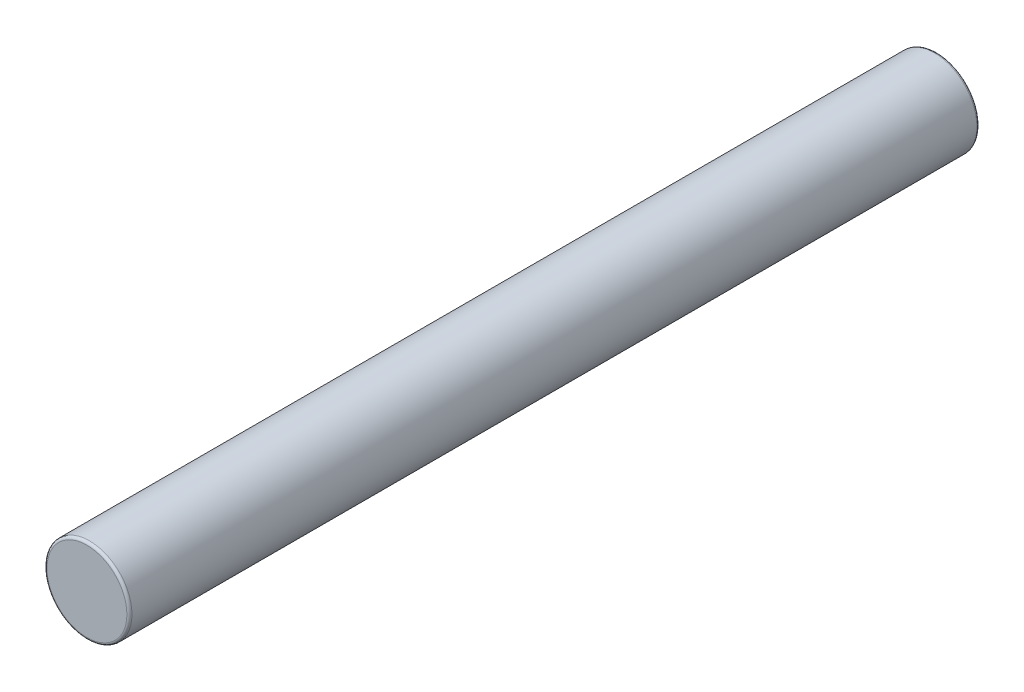
ISO-10303-21;
HEADER;
FILE_DESCRIPTION(('STEP AP214'),'2;1');
FILE_NAME('part.step','',(''),(''),'','','');
FILE_SCHEMA(('AUTOMOTIVE_DESIGN { 1 0 10303 214 1 1 1 1 }'));
ENDSEC;
DATA;
#1=APPLICATION_CONTEXT('core data for automotive mechanical design processes');
#2=APPLICATION_PROTOCOL_DEFINITION('international standard','automotive_design',2000,#1);
#3=PRODUCT_CONTEXT('',#1,'mechanical');
#4=PRODUCT('Part','Part','',(#3));
#5=PRODUCT_RELATED_PRODUCT_CATEGORY('part','',(#4));
#6=PRODUCT_DEFINITION_FORMATION('','',#4);
#7=PRODUCT_DEFINITION_CONTEXT('part definition',#1,'design');
#8=PRODUCT_DEFINITION('design','',#6,#7);
#9=PRODUCT_DEFINITION_SHAPE('','',#8);
#10=(LENGTH_UNIT() NAMED_UNIT(*) SI_UNIT(.MILLI.,.METRE.));
#11=(NAMED_UNIT(*) PLANE_ANGLE_UNIT() SI_UNIT($,.RADIAN.));
#12=(NAMED_UNIT(*) SI_UNIT($,.STERADIAN.) SOLID_ANGLE_UNIT());
#13=UNCERTAINTY_MEASURE_WITH_UNIT(LENGTH_MEASURE(1.E-05),#10,'distance_accuracy_value','');
#14=(GEOMETRIC_REPRESENTATION_CONTEXT(3) GLOBAL_UNCERTAINTY_ASSIGNED_CONTEXT((#13)) GLOBAL_UNIT_ASSIGNED_CONTEXT((#10,
#11,#12)) REPRESENTATION_CONTEXT('',''));
#15=CARTESIAN_POINT('',(0.,0.,0.));
#16=DIRECTION('',(0.,0.,1.));
#17=DIRECTION('',(1.,0.,0.));
#18=AXIS2_PLACEMENT_3D('',#15,#16,#17);
#19=CARTESIAN_POINT('',(0.,0.,50.));
#20=DIRECTION('',(0.,0.,-1.));
#21=DIRECTION('',(-1.,0.,0.));
#22=AXIS2_PLACEMENT_3D('',#19,#20,#21);
#23=CYLINDRICAL_SURFACE('',#22,5.);
#24=CARTESIAN_POINT('',(0.,0.,-49.7));
#25=DIRECTION('',(0.,0.,1.));
#26=DIRECTION('',(1.,0.,0.));
#27=AXIS2_PLACEMENT_3D('',#24,#25,#26);
#28=CIRCLE('',#27,5.);
#29=CARTESIAN_POINT('',(5.,0.,-49.7));
#30=VERTEX_POINT('',#29);
#31=EDGE_CURVE('E52',#30,#30,#28,.T.);
#32=ORIENTED_EDGE('',*,*,#31,.T.);
#33=EDGE_LOOP('',(#32));
#34=FACE_BOUND('',#33,.T.);
#35=CARTESIAN_POINT('',(0.,0.,49.7));
#36=DIRECTION('',(0.,0.,1.));
#37=DIRECTION('',(1.,0.,0.));
#38=AXIS2_PLACEMENT_3D('',#35,#36,#37);
#39=CIRCLE('',#38,5.);
#40=CARTESIAN_POINT('',(5.,0.,49.7));
#41=VERTEX_POINT('',#40);
#42=EDGE_CURVE('E58',#41,#41,#39,.F.);
#43=ORIENTED_EDGE('',*,*,#42,.T.);
#44=EDGE_LOOP('',(#43));
#45=FACE_BOUND('',#44,.T.);
#46=ADVANCED_FACE('F38',(#34,#45),#23,.T.);
#47=CARTESIAN_POINT('',(0.,0.,50.));
#48=DIRECTION('',(0.,0.,1.));
#49=DIRECTION('',(1.,0.,0.));
#50=AXIS2_PLACEMENT_3D('',#47,#48,#49);
#51=PLANE('',#50);
#52=CARTESIAN_POINT('',(0.,0.,50.));
#53=DIRECTION('',(0.,0.,1.));
#54=DIRECTION('',(1.,0.,0.));
#55=AXIS2_PLACEMENT_3D('',#52,#53,#54);
#56=CIRCLE('',#55,4.7);
#57=CARTESIAN_POINT('',(4.7,0.,50.));
#58=VERTEX_POINT('',#57);
#59=EDGE_CURVE('E10',#58,#58,#56,.T.);
#60=ORIENTED_EDGE('',*,*,#59,.T.);
#61=EDGE_LOOP('',(#60));
#62=FACE_BOUND('',#61,.T.);
#63=ADVANCED_FACE('F76',(#62),#51,.T.);
#64=CARTESIAN_POINT('',(0.,0.,-50.));
#65=DIRECTION('',(0.,0.,1.));
#66=DIRECTION('',(1.,0.,0.));
#67=AXIS2_PLACEMENT_3D('',#64,#65,#66);
#68=PLANE('',#67);
#69=CARTESIAN_POINT('',(0.,0.,-50.));
#70=DIRECTION('',(0.,0.,1.));
#71=DIRECTION('',(1.,0.,0.));
#72=AXIS2_PLACEMENT_3D('',#69,#70,#71);
#73=CIRCLE('',#72,4.7);
#74=CARTESIAN_POINT('',(4.7,0.,-50.));
#75=VERTEX_POINT('',#74);
#76=EDGE_CURVE('E46',#75,#75,#73,.F.);
#77=ORIENTED_EDGE('',*,*,#76,.T.);
#78=EDGE_LOOP('',(#77));
#79=FACE_BOUND('',#78,.T.);
#80=ADVANCED_FACE('F73',(#79),#68,.F.);
#81=CARTESIAN_POINT('',(0.,0.,-49.7));
#82=DIRECTION('',(0.,0.,1.));
#83=DIRECTION('',(1.,0.,0.));
#84=AXIS2_PLACEMENT_3D('',#81,#82,#83);
#85=TOROIDAL_SURFACE('',#84,4.7,0.3);
#86=ORIENTED_EDGE('',*,*,#76,.F.);
#87=EDGE_LOOP('',(#86));
#88=FACE_BOUND('',#87,.T.);
#89=ORIENTED_EDGE('',*,*,#31,.F.);
#90=EDGE_LOOP('',(#89));
#91=FACE_BOUND('',#90,.T.);
#92=ADVANCED_FACE('F69',(#88,#91),#85,.T.);
#93=CARTESIAN_POINT('',(0.,0.,49.7));
#94=DIRECTION('',(0.,0.,1.));
#95=DIRECTION('',(1.,0.,0.));
#96=AXIS2_PLACEMENT_3D('',#93,#94,#95);
#97=TOROIDAL_SURFACE('',#96,4.7,0.3);
#98=ORIENTED_EDGE('',*,*,#42,.F.);
#99=EDGE_LOOP('',(#98));
#100=FACE_BOUND('',#99,.T.);
#101=ORIENTED_EDGE('',*,*,#59,.F.);
#102=EDGE_LOOP('',(#101));
#103=FACE_BOUND('',#102,.T.);
#104=ADVANCED_FACE('F40',(#100,#103),#97,.T.);
#105=CLOSED_SHELL('',(#46,#63,#80,#92,#104));
#106=MANIFOLD_SOLID_BREP('B2',#105);
#107=ADVANCED_BREP_SHAPE_REPRESENTATION('',(#18,#106),#14);
#108=SHAPE_DEFINITION_REPRESENTATION(#9,#107);
ENDSEC;
END-ISO-10303-21;
